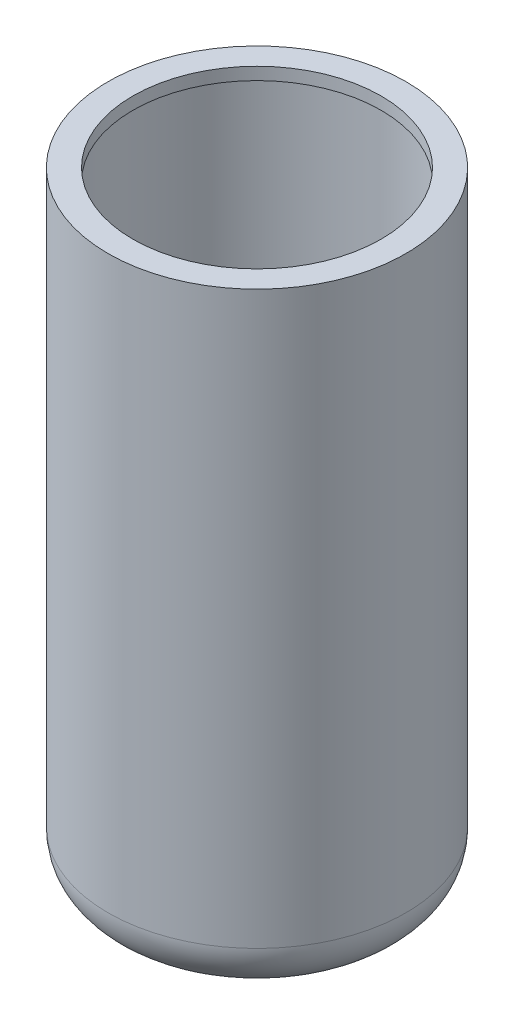
ISO-10303-21;
HEADER;
FILE_DESCRIPTION(('STEP AP214'),'2;1');
FILE_NAME('part.step','',(''),(''),'','','');
FILE_SCHEMA(('AUTOMOTIVE_DESIGN { 1 0 10303 214 1 1 1 1 }'));
ENDSEC;
DATA;
#1=APPLICATION_CONTEXT('core data for automotive mechanical design processes');
#2=APPLICATION_PROTOCOL_DEFINITION('international standard','automotive_design',2000,#1);
#3=PRODUCT_CONTEXT('',#1,'mechanical');
#4=PRODUCT('Part','Part','',(#3));
#5=PRODUCT_RELATED_PRODUCT_CATEGORY('part','',(#4));
#6=PRODUCT_DEFINITION_FORMATION('','',#4);
#7=PRODUCT_DEFINITION_CONTEXT('part definition',#1,'design');
#8=PRODUCT_DEFINITION('design','',#6,#7);
#9=PRODUCT_DEFINITION_SHAPE('','',#8);
#10=(LENGTH_UNIT() NAMED_UNIT(*) SI_UNIT(.MILLI.,.METRE.));
#11=(NAMED_UNIT(*) PLANE_ANGLE_UNIT() SI_UNIT($,.RADIAN.));
#12=(NAMED_UNIT(*) SI_UNIT($,.STERADIAN.) SOLID_ANGLE_UNIT());
#13=UNCERTAINTY_MEASURE_WITH_UNIT(LENGTH_MEASURE(1.E-05),#10,'distance_accuracy_value','');
#14=(GEOMETRIC_REPRESENTATION_CONTEXT(3) GLOBAL_UNCERTAINTY_ASSIGNED_CONTEXT((#13)) GLOBAL_UNIT_ASSIGNED_CONTEXT((#10,
#11,#12)) REPRESENTATION_CONTEXT('',''));
#15=CARTESIAN_POINT('',(0.,0.,0.));
#16=DIRECTION('',(0.,0.,1.));
#17=DIRECTION('',(1.,0.,0.));
#18=AXIS2_PLACEMENT_3D('',#15,#16,#17);
#19=CARTESIAN_POINT('',(0.,63.5,0.));
#20=DIRECTION('',(0.,1.,0.));
#21=DIRECTION('',(0.,0.,1.));
#22=AXIS2_PLACEMENT_3D('',#19,#20,#21);
#23=PLANE('',#22);
#24=CARTESIAN_POINT('',(0.,63.5,0.));
#25=DIRECTION('',(0.,-1.,0.));
#26=DIRECTION('',(0.,0.,-1.));
#27=AXIS2_PLACEMENT_3D('',#24,#25,#26);
#28=CIRCLE('',#27,15.24);
#29=CARTESIAN_POINT('',(0.,63.5,-15.24));
#30=VERTEX_POINT('',#29);
#31=EDGE_CURVE('E48',#30,#30,#28,.T.);
#32=ORIENTED_EDGE('',*,*,#31,.F.);
#33=EDGE_LOOP('',(#32));
#34=FACE_BOUND('',#33,.T.);
#35=CARTESIAN_POINT('',(0.,63.5,0.));
#36=DIRECTION('',(0.,1.,0.));
#37=DIRECTION('',(0.,0.,1.));
#38=AXIS2_PLACEMENT_3D('',#35,#36,#37);
#39=CIRCLE('',#38,12.7);
#40=CARTESIAN_POINT('',(0.,63.5,12.7));
#41=VERTEX_POINT('',#40);
#42=EDGE_CURVE('E60',#41,#41,#39,.T.);
#43=ORIENTED_EDGE('',*,*,#42,.F.);
#44=EDGE_LOOP('',(#43));
#45=FACE_BOUND('',#44,.T.);
#46=ADVANCED_FACE('F33',(#34,#45),#23,.T.);
#47=CARTESIAN_POINT('',(0.,0.,0.));
#48=DIRECTION('',(0.,-1.,0.));
#49=DIRECTION('',(0.,0.,-1.));
#50=AXIS2_PLACEMENT_3D('',#47,#48,#49);
#51=CYLINDRICAL_SURFACE('',#50,15.24);
#52=CARTESIAN_POINT('',(0.,5.08,0.));
#53=DIRECTION('',(0.,-1.,0.));
#54=DIRECTION('',(0.,0.,-1.));
#55=AXIS2_PLACEMENT_3D('',#52,#53,#54);
#56=CIRCLE('',#55,15.24);
#57=CARTESIAN_POINT('',(0.,5.08,-15.24));
#58=VERTEX_POINT('',#57);
#59=EDGE_CURVE('E40',#58,#58,#56,.F.);
#60=ORIENTED_EDGE('',*,*,#59,.T.);
#61=EDGE_LOOP('',(#60));
#62=FACE_BOUND('',#61,.T.);
#63=ORIENTED_EDGE('',*,*,#31,.T.);
#64=EDGE_LOOP('',(#63));
#65=FACE_BOUND('',#64,.T.);
#66=ADVANCED_FACE('F76',(#62,#65),#51,.T.);
#67=CARTESIAN_POINT('',(0.,0.,0.));
#68=DIRECTION('',(0.,-1.,0.));
#69=DIRECTION('',(0.,0.,-1.));
#70=AXIS2_PLACEMENT_3D('',#67,#68,#69);
#71=PLANE('',#70);
#72=CARTESIAN_POINT('',(0.,0.,0.));
#73=DIRECTION('',(0.,-1.,0.));
#74=DIRECTION('',(0.,0.,-1.));
#75=AXIS2_PLACEMENT_3D('',#72,#73,#74);
#76=CIRCLE('',#75,10.16);
#77=CARTESIAN_POINT('',(0.,0.,-10.16));
#78=VERTEX_POINT('',#77);
#79=EDGE_CURVE('E44',#78,#78,#76,.T.);
#80=ORIENTED_EDGE('',*,*,#79,.T.);
#81=EDGE_LOOP('',(#80));
#82=FACE_BOUND('',#81,.T.);
#83=ADVANCED_FACE('F81',(#82),#71,.T.);
#84=CARTESIAN_POINT('',(0.,5.08,0.));
#85=DIRECTION('',(0.,-1.,0.));
#86=DIRECTION('',(0.,0.,-1.));
#87=AXIS2_PLACEMENT_3D('',#84,#85,#86);
#88=TOROIDAL_SURFACE('',#87,10.16,5.08);
#89=ORIENTED_EDGE('',*,*,#59,.F.);
#90=EDGE_LOOP('',(#89));
#91=FACE_BOUND('',#90,.T.);
#92=ORIENTED_EDGE('',*,*,#79,.F.);
#93=EDGE_LOOP('',(#92));
#94=FACE_BOUND('',#93,.T.);
#95=ADVANCED_FACE('F35',(#91,#94),#88,.T.);
#96=CARTESIAN_POINT('',(0.,62.23,0.));
#97=DIRECTION('',(0.,1.,0.));
#98=DIRECTION('',(0.,0.,1.));
#99=AXIS2_PLACEMENT_3D('',#96,#97,#98);
#100=PLANE('',#99);
#101=CARTESIAN_POINT('',(0.,62.23,0.));
#102=DIRECTION('',(0.,1.,0.));
#103=DIRECTION('',(0.,0.,1.));
#104=AXIS2_PLACEMENT_3D('',#101,#102,#103);
#105=CIRCLE('',#104,12.7);
#106=CARTESIAN_POINT('',(0.,62.23,12.7));
#107=VERTEX_POINT('',#106);
#108=EDGE_CURVE('E57',#107,#107,#105,.T.);
#109=ORIENTED_EDGE('',*,*,#108,.T.);
#110=EDGE_LOOP('',(#109));
#111=FACE_BOUND('',#110,.T.);
#112=CARTESIAN_POINT('',(0.,62.23,0.));
#113=DIRECTION('',(0.,1.,0.));
#114=DIRECTION('',(0.,0.,1.));
#115=AXIS2_PLACEMENT_3D('',#112,#113,#114);
#116=CIRCLE('',#115,13.97);
#117=CARTESIAN_POINT('',(0.,62.23,13.97));
#118=VERTEX_POINT('',#117);
#119=EDGE_CURVE('E10',#118,#118,#116,.F.);
#120=ORIENTED_EDGE('',*,*,#119,.T.);
#121=EDGE_LOOP('',(#120));
#122=FACE_BOUND('',#121,.T.);
#123=ADVANCED_FACE('F66',(#111,#122),#100,.F.);
#124=CARTESIAN_POINT('',(0.,62.23,0.));
#125=DIRECTION('',(0.,1.,0.));
#126=DIRECTION('',(0.,0.,1.));
#127=AXIS2_PLACEMENT_3D('',#124,#125,#126);
#128=CYLINDRICAL_SURFACE('',#127,12.7);
#129=ORIENTED_EDGE('',*,*,#108,.F.);
#130=EDGE_LOOP('',(#129));
#131=FACE_BOUND('',#130,.T.);
#132=ORIENTED_EDGE('',*,*,#42,.T.);
#133=EDGE_LOOP('',(#132));
#134=FACE_BOUND('',#133,.T.);
#135=ADVANCED_FACE('F68',(#131,#134),#128,.F.);
#136=CARTESIAN_POINT('',(0.,1.27,0.));
#137=DIRECTION('',(0.,-1.,0.));
#138=DIRECTION('',(0.,0.,-1.));
#139=AXIS2_PLACEMENT_3D('',#136,#137,#138);
#140=PLANE('',#139);
#141=CARTESIAN_POINT('',(0.,1.27,0.));
#142=DIRECTION('',(0.,-1.,0.));
#143=DIRECTION('',(0.,0.,-1.));
#144=AXIS2_PLACEMENT_3D('',#141,#142,#143);
#145=CIRCLE('',#144,10.16);
#146=CARTESIAN_POINT('',(0.,1.27,-10.16));
#147=VERTEX_POINT('',#146);
#148=EDGE_CURVE('E54',#147,#147,#145,.T.);
#149=ORIENTED_EDGE('',*,*,#148,.F.);
#150=EDGE_LOOP('',(#149));
#151=FACE_BOUND('',#150,.T.);
#152=ADVANCED_FACE('F71',(#151),#140,.F.);
#153=CARTESIAN_POINT('',(0.,5.08,0.));
#154=DIRECTION('',(0.,-1.,0.));
#155=DIRECTION('',(0.,0.,-1.));
#156=AXIS2_PLACEMENT_3D('',#153,#154,#155);
#157=TOROIDAL_SURFACE('',#156,10.16,3.81);
#158=CARTESIAN_POINT('',(0.,5.08,0.));
#159=DIRECTION('',(0.,-1.,0.));
#160=DIRECTION('',(0.,0.,-1.));
#161=AXIS2_PLACEMENT_3D('',#158,#159,#160);
#162=CIRCLE('',#161,13.97);
#163=CARTESIAN_POINT('',(0.,5.08,-13.97));
#164=VERTEX_POINT('',#163);
#165=EDGE_CURVE('E53',#164,#164,#162,.F.);
#166=ORIENTED_EDGE('',*,*,#165,.T.);
#167=EDGE_LOOP('',(#166));
#168=FACE_BOUND('',#167,.T.);
#169=ORIENTED_EDGE('',*,*,#148,.T.);
#170=EDGE_LOOP('',(#169));
#171=FACE_BOUND('',#170,.T.);
#172=ADVANCED_FACE('F88',(#168,#171),#157,.F.);
#173=CARTESIAN_POINT('',(0.,0.,0.));
#174=DIRECTION('',(0.,-1.,0.));
#175=DIRECTION('',(0.,0.,-1.));
#176=AXIS2_PLACEMENT_3D('',#173,#174,#175);
#177=CYLINDRICAL_SURFACE('',#176,13.97);
#178=ORIENTED_EDGE('',*,*,#165,.F.);
#179=EDGE_LOOP('',(#178));
#180=FACE_BOUND('',#179,.T.);
#181=ORIENTED_EDGE('',*,*,#119,.F.);
#182=EDGE_LOOP('',(#181));
#183=FACE_BOUND('',#182,.T.);
#184=ADVANCED_FACE('F91',(#180,#183),#177,.F.);
#185=CLOSED_SHELL('',(#46,#66,#83,#95,#123,#135,#152,#172,#184));
#186=MANIFOLD_SOLID_BREP('B2',#185);
#187=ADVANCED_BREP_SHAPE_REPRESENTATION('',(#18,#186),#14);
#188=SHAPE_DEFINITION_REPRESENTATION(#9,#187);
ENDSEC;
END-ISO-10303-21;
